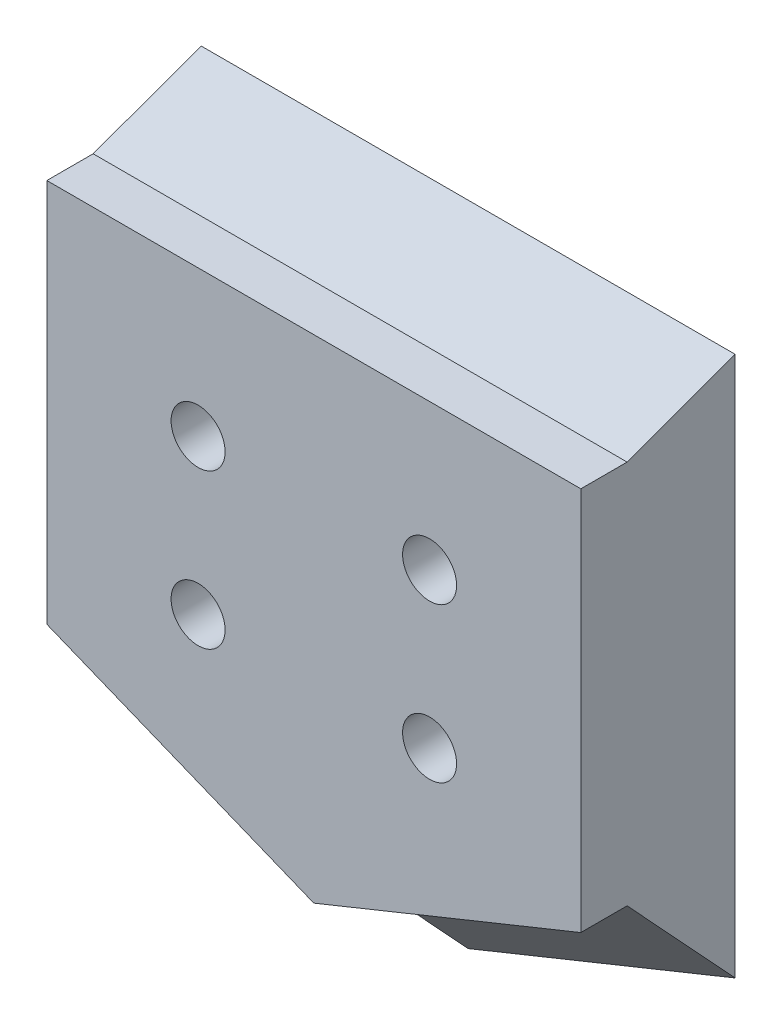
ISO-10303-21;
HEADER;
FILE_DESCRIPTION(('STEP AP214'),'2;1');
FILE_NAME('part.step','',(''),(''),'','','');
FILE_SCHEMA(('AUTOMOTIVE_DESIGN { 1 0 10303 214 1 1 1 1 }'));
ENDSEC;
DATA;
#1=APPLICATION_CONTEXT('core data for automotive mechanical design processes');
#2=APPLICATION_PROTOCOL_DEFINITION('international standard','automotive_design',2000,#1);
#3=PRODUCT_CONTEXT('',#1,'mechanical');
#4=PRODUCT('Part','Part','',(#3));
#5=PRODUCT_RELATED_PRODUCT_CATEGORY('part','',(#4));
#6=PRODUCT_DEFINITION_FORMATION('','',#4);
#7=PRODUCT_DEFINITION_CONTEXT('part definition',#1,'design');
#8=PRODUCT_DEFINITION('design','',#6,#7);
#9=PRODUCT_DEFINITION_SHAPE('','',#8);
#10=(LENGTH_UNIT() NAMED_UNIT(*) SI_UNIT(.MILLI.,.METRE.));
#11=(NAMED_UNIT(*) PLANE_ANGLE_UNIT() SI_UNIT($,.RADIAN.));
#12=(NAMED_UNIT(*) SI_UNIT($,.STERADIAN.) SOLID_ANGLE_UNIT());
#13=UNCERTAINTY_MEASURE_WITH_UNIT(LENGTH_MEASURE(1.E-05),#10,'distance_accuracy_value','');
#14=(GEOMETRIC_REPRESENTATION_CONTEXT(3) GLOBAL_UNCERTAINTY_ASSIGNED_CONTEXT((#13)) GLOBAL_UNIT_ASSIGNED_CONTEXT((#10,
#11,#12)) REPRESENTATION_CONTEXT('',''));
#15=CARTESIAN_POINT('',(0.,0.,0.));
#16=DIRECTION('',(0.,0.,1.));
#17=DIRECTION('',(1.,0.,0.));
#18=AXIS2_PLACEMENT_3D('',#15,#16,#17);
#19=CARTESIAN_POINT('',(-7.5,3.5,0.));
#20=DIRECTION('',(0.,0.,1.));
#21=DIRECTION('',(1.,0.,0.));
#22=AXIS2_PLACEMENT_3D('',#19,#20,#21);
#23=CYLINDRICAL_SURFACE('',#22,1.75);
#24=CARTESIAN_POINT('',(-7.5,3.5,10.));
#25=DIRECTION('',(0.,0.,1.));
#26=DIRECTION('',(-1.,0.,0.));
#27=AXIS2_PLACEMENT_3D('',#24,#25,#26);
#28=CIRCLE('',#27,1.75);
#29=CARTESIAN_POINT('',(-9.25,3.5,10.));
#30=VERTEX_POINT('',#29);
#31=EDGE_CURVE('E153',#30,#30,#28,.T.);
#32=ORIENTED_EDGE('',*,*,#31,.T.);
#33=EDGE_LOOP('',(#32));
#34=FACE_BOUND('',#33,.T.);
#35=CARTESIAN_POINT('',(-7.5,3.5,3.));
#36=DIRECTION('',(0.,0.,-1.));
#37=DIRECTION('',(-1.,0.,0.));
#38=AXIS2_PLACEMENT_3D('',#35,#36,#37);
#39=CIRCLE('',#38,1.75);
#40=CARTESIAN_POINT('',(-9.25,3.5,3.));
#41=VERTEX_POINT('',#40);
#42=EDGE_CURVE('E39',#41,#41,#39,.F.);
#43=ORIENTED_EDGE('',*,*,#42,.F.);
#44=EDGE_LOOP('',(#43));
#45=FACE_BOUND('',#44,.T.);
#46=ADVANCED_FACE('F35',(#34,#45),#23,.F.);
#47=CARTESIAN_POINT('',(-7.5,-6.5,0.));
#48=DIRECTION('',(0.,0.,1.));
#49=DIRECTION('',(1.,0.,0.));
#50=AXIS2_PLACEMENT_3D('',#47,#48,#49);
#51=CYLINDRICAL_SURFACE('',#50,1.75);
#52=CARTESIAN_POINT('',(-7.5,-6.5,10.));
#53=DIRECTION('',(0.,0.,1.));
#54=DIRECTION('',(-1.,0.,0.));
#55=AXIS2_PLACEMENT_3D('',#52,#53,#54);
#56=CIRCLE('',#55,1.75);
#57=CARTESIAN_POINT('',(-9.25,-6.5,10.));
#58=VERTEX_POINT('',#57);
#59=EDGE_CURVE('E177',#58,#58,#56,.T.);
#60=ORIENTED_EDGE('',*,*,#59,.T.);
#61=EDGE_LOOP('',(#60));
#62=FACE_BOUND('',#61,.T.);
#63=CARTESIAN_POINT('',(-7.5,-6.5,3.));
#64=DIRECTION('',(0.,0.,-1.));
#65=DIRECTION('',(-1.,0.,0.));
#66=AXIS2_PLACEMENT_3D('',#63,#64,#65);
#67=CIRCLE('',#66,1.75);
#68=CARTESIAN_POINT('',(-9.25,-6.5,3.));
#69=VERTEX_POINT('',#68);
#70=EDGE_CURVE('E157',#69,#69,#67,.F.);
#71=ORIENTED_EDGE('',*,*,#70,.F.);
#72=EDGE_LOOP('',(#71));
#73=FACE_BOUND('',#72,.T.);
#74=ADVANCED_FACE('F224',(#62,#73),#51,.F.);
#75=CARTESIAN_POINT('',(7.5,-6.5,0.));
#76=DIRECTION('',(0.,0.,1.));
#77=DIRECTION('',(1.,0.,0.));
#78=AXIS2_PLACEMENT_3D('',#75,#76,#77);
#79=CYLINDRICAL_SURFACE('',#78,1.75);
#80=CARTESIAN_POINT('',(7.5,-6.5,10.));
#81=DIRECTION('',(0.,0.,1.));
#82=DIRECTION('',(1.,0.,0.));
#83=AXIS2_PLACEMENT_3D('',#80,#81,#82);
#84=CIRCLE('',#83,1.75);
#85=CARTESIAN_POINT('',(9.25,-6.5,10.));
#86=VERTEX_POINT('',#85);
#87=EDGE_CURVE('E174',#86,#86,#84,.T.);
#88=ORIENTED_EDGE('',*,*,#87,.T.);
#89=EDGE_LOOP('',(#88));
#90=FACE_BOUND('',#89,.T.);
#91=CARTESIAN_POINT('',(7.5,-6.5,3.));
#92=DIRECTION('',(0.,0.,-1.));
#93=DIRECTION('',(-1.,0.,0.));
#94=AXIS2_PLACEMENT_3D('',#91,#92,#93);
#95=CIRCLE('',#94,1.75);
#96=CARTESIAN_POINT('',(5.75,-6.5,3.));
#97=VERTEX_POINT('',#96);
#98=EDGE_CURVE('E155',#97,#97,#95,.F.);
#99=ORIENTED_EDGE('',*,*,#98,.F.);
#100=EDGE_LOOP('',(#99));
#101=FACE_BOUND('',#100,.T.);
#102=ADVANCED_FACE('F230',(#90,#101),#79,.F.);
#103=CARTESIAN_POINT('',(7.5,3.5,0.));
#104=DIRECTION('',(0.,0.,1.));
#105=DIRECTION('',(1.,0.,0.));
#106=AXIS2_PLACEMENT_3D('',#103,#104,#105);
#107=CYLINDRICAL_SURFACE('',#106,1.75);
#108=CARTESIAN_POINT('',(7.5,3.5,10.));
#109=DIRECTION('',(0.,0.,1.));
#110=DIRECTION('',(1.,0.,0.));
#111=AXIS2_PLACEMENT_3D('',#108,#109,#110);
#112=CIRCLE('',#111,1.75);
#113=CARTESIAN_POINT('',(9.25,3.5,10.));
#114=VERTEX_POINT('',#113);
#115=EDGE_CURVE('E116',#114,#114,#112,.T.);
#116=ORIENTED_EDGE('',*,*,#115,.T.);
#117=EDGE_LOOP('',(#116));
#118=FACE_BOUND('',#117,.T.);
#119=CARTESIAN_POINT('',(7.5,3.5,3.));
#120=DIRECTION('',(0.,0.,-1.));
#121=DIRECTION('',(-1.,0.,0.));
#122=AXIS2_PLACEMENT_3D('',#119,#120,#121);
#123=CIRCLE('',#122,1.75);
#124=CARTESIAN_POINT('',(5.75,3.5,3.));
#125=VERTEX_POINT('',#124);
#126=EDGE_CURVE('E150',#125,#125,#123,.F.);
#127=ORIENTED_EDGE('',*,*,#126,.F.);
#128=EDGE_LOOP('',(#127));
#129=FACE_BOUND('',#128,.T.);
#130=ADVANCED_FACE('F236',(#118,#129),#107,.F.);
#131=CARTESIAN_POINT('',(17.3,13.,7.));
#132=DIRECTION('',(-1.,0.,0.));
#133=DIRECTION('',(0.,0.,1.));
#134=AXIS2_PLACEMENT_3D('',#131,#132,#133);
#135=PLANE('',#134);
#136=DIRECTION('',(0.,1.,0.));
#137=VECTOR('',#136,1.);
#138=CARTESIAN_POINT('',(17.3,13.,0.));
#139=LINE('',#138,#137);
#140=CARTESIAN_POINT('',(17.3,-19.5,0.));
#141=VERTEX_POINT('',#140);
#142=CARTESIAN_POINT('',(17.3,15.5,0.));
#143=VERTEX_POINT('',#142);
#144=EDGE_CURVE('E136',#141,#143,#139,.T.);
#145=ORIENTED_EDGE('',*,*,#144,.T.);
#146=DIRECTION('',(0.,0.342020143325666,-0.939692620785909));
#147=VECTOR('',#146,1.);
#148=CARTESIAN_POINT('',(17.3,15.5,0.));
#149=LINE('',#148,#147);
#150=CARTESIAN_POINT('',(17.3,12.9522083601366,7.));
#151=VERTEX_POINT('',#150);
#152=EDGE_CURVE('E58',#143,#151,#149,.F.);
#153=ORIENTED_EDGE('',*,*,#152,.T.);
#154=DIRECTION('',(0.,0.,-1.));
#155=VECTOR('',#154,1.);
#156=CARTESIAN_POINT('',(17.3,12.9522083601366,10.));
#157=LINE('',#156,#155);
#158=CARTESIAN_POINT('',(17.3,12.9522083601366,10.));
#159=VERTEX_POINT('',#158);
#160=EDGE_CURVE('E103',#159,#151,#157,.T.);
#161=ORIENTED_EDGE('',*,*,#160,.F.);
#162=DIRECTION('',(0.,1.,0.));
#163=VECTOR('',#162,1.);
#164=CARTESIAN_POINT('',(17.3,-11.9486875651011,10.));
#165=LINE('',#164,#163);
#166=CARTESIAN_POINT('',(17.3,-11.9486875651011,10.));
#167=VERTEX_POINT('',#166);
#168=EDGE_CURVE('E96',#167,#159,#165,.T.);
#169=ORIENTED_EDGE('',*,*,#168,.F.);
#170=DIRECTION('',(0.,0.,-1.));
#171=VECTOR('',#170,1.);
#172=CARTESIAN_POINT('',(17.3,-11.9486875651011,10.));
#173=LINE('',#172,#171);
#174=CARTESIAN_POINT('',(17.3,-11.9486875651011,7.));
#175=VERTEX_POINT('',#174);
#176=EDGE_CURVE('E100',#167,#175,#173,.T.);
#177=ORIENTED_EDGE('',*,*,#176,.T.);
#178=DIRECTION('',(0.,0.733371095333155,0.679828534654032));
#179=VECTOR('',#178,1.);
#180=CARTESIAN_POINT('',(17.3,-19.5,0.));
#181=LINE('',#180,#179);
#182=EDGE_CURVE('E144',#175,#141,#181,.F.);
#183=ORIENTED_EDGE('',*,*,#182,.T.);
#184=EDGE_LOOP('',(#145,#153,#161,#169,#177,#183));
#185=FACE_BOUND('',#184,.T.);
#186=ADVANCED_FACE('F98',(#185),#135,.F.);
#187=CARTESIAN_POINT('',(-17.3,13.,7.));
#188=DIRECTION('',(1.,0.,0.));
#189=DIRECTION('',(0.,1.,0.));
#190=AXIS2_PLACEMENT_3D('',#187,#188,#189);
#191=PLANE('',#190);
#192=DIRECTION('',(0.,-0.733371095333155,-0.679828534654032));
#193=VECTOR('',#192,1.);
#194=CARTESIAN_POINT('',(-17.3,-23.2648321442911,-3.48996617968573));
#195=LINE('',#194,#193);
#196=CARTESIAN_POINT('',(-17.3,-19.5,0.));
#197=VERTEX_POINT('',#196);
#198=CARTESIAN_POINT('',(-17.3,-11.9486875651011,7.));
#199=VERTEX_POINT('',#198);
#200=EDGE_CURVE('E146',#197,#199,#195,.F.);
#201=ORIENTED_EDGE('',*,*,#200,.T.);
#202=DIRECTION('',(0.,0.,-1.));
#203=VECTOR('',#202,1.);
#204=CARTESIAN_POINT('',(-17.3,-11.9486875651011,10.));
#205=LINE('',#204,#203);
#206=CARTESIAN_POINT('',(-17.3,-11.9486875651011,10.));
#207=VERTEX_POINT('',#206);
#208=EDGE_CURVE('E190',#207,#199,#205,.T.);
#209=ORIENTED_EDGE('',*,*,#208,.F.);
#210=DIRECTION('',(0.,-1.,0.));
#211=VECTOR('',#210,1.);
#212=CARTESIAN_POINT('',(-17.3,12.9522083601366,10.));
#213=LINE('',#212,#211);
#214=CARTESIAN_POINT('',(-17.3,12.9522083601366,10.));
#215=VERTEX_POINT('',#214);
#216=EDGE_CURVE('E185',#215,#207,#213,.T.);
#217=ORIENTED_EDGE('',*,*,#216,.F.);
#218=DIRECTION('',(0.,0.,-1.));
#219=VECTOR('',#218,1.);
#220=CARTESIAN_POINT('',(-17.3,12.9522083601366,10.));
#221=LINE('',#220,#219);
#222=CARTESIAN_POINT('',(-17.3,12.9522083601366,7.));
#223=VERTEX_POINT('',#222);
#224=EDGE_CURVE('E124',#215,#223,#221,.T.);
#225=ORIENTED_EDGE('',*,*,#224,.T.);
#226=DIRECTION('',(0.,-0.342020143325666,0.939692620785909));
#227=VECTOR('',#226,1.);
#228=CARTESIAN_POINT('',(-17.3,15.5,0.));
#229=LINE('',#228,#227);
#230=CARTESIAN_POINT('',(-17.3,15.5,0.));
#231=VERTEX_POINT('',#230);
#232=EDGE_CURVE('E11',#223,#231,#229,.F.);
#233=ORIENTED_EDGE('',*,*,#232,.T.);
#234=DIRECTION('',(0.,-1.,0.));
#235=VECTOR('',#234,1.);
#236=CARTESIAN_POINT('',(-17.3,13.,0.));
#237=LINE('',#236,#235);
#238=EDGE_CURVE('E138',#231,#197,#237,.T.);
#239=ORIENTED_EDGE('',*,*,#238,.T.);
#240=EDGE_LOOP('',(#201,#209,#217,#225,#233,#239));
#241=FACE_BOUND('',#240,.T.);
#242=ADVANCED_FACE('F196',(#241),#191,.F.);
#243=CARTESIAN_POINT('',(0.,0.,0.));
#244=DIRECTION('',(0.,0.,1.));
#245=DIRECTION('',(1.,0.,0.));
#246=AXIS2_PLACEMENT_3D('',#243,#244,#245);
#247=PLANE('',#246);
#248=CARTESIAN_POINT('',(-7.5,3.5,0.));
#249=DIRECTION('',(0.,0.,-1.));
#250=DIRECTION('',(-1.,0.,0.));
#251=AXIS2_PLACEMENT_3D('',#248,#249,#250);
#252=CIRCLE('',#251,3.5);
#253=CARTESIAN_POINT('',(-11.,3.5,0.));
#254=VERTEX_POINT('',#253);
#255=EDGE_CURVE('E286',#254,#254,#252,.T.);
#256=ORIENTED_EDGE('',*,*,#255,.F.);
#257=EDGE_LOOP('',(#256));
#258=FACE_BOUND('',#257,.T.);
#259=CARTESIAN_POINT('',(7.5,-6.5,0.));
#260=DIRECTION('',(0.,0.,-1.));
#261=DIRECTION('',(-1.,0.,0.));
#262=AXIS2_PLACEMENT_3D('',#259,#260,#261);
#263=CIRCLE('',#262,3.5);
#264=CARTESIAN_POINT('',(4.,-6.5,0.));
#265=VERTEX_POINT('',#264);
#266=EDGE_CURVE('E294',#265,#265,#263,.T.);
#267=ORIENTED_EDGE('',*,*,#266,.F.);
#268=EDGE_LOOP('',(#267));
#269=FACE_BOUND('',#268,.T.);
#270=CARTESIAN_POINT('',(-7.5,-6.5,0.));
#271=DIRECTION('',(0.,0.,-1.));
#272=DIRECTION('',(-1.,0.,0.));
#273=AXIS2_PLACEMENT_3D('',#270,#271,#272);
#274=CIRCLE('',#273,3.5);
#275=CARTESIAN_POINT('',(-11.,-6.5,0.));
#276=VERTEX_POINT('',#275);
#277=EDGE_CURVE('E299',#276,#276,#274,.T.);
#278=ORIENTED_EDGE('',*,*,#277,.F.);
#279=EDGE_LOOP('',(#278));
#280=FACE_BOUND('',#279,.T.);
#281=CARTESIAN_POINT('',(7.5,3.5,0.));
#282=DIRECTION('',(0.,0.,-1.));
#283=DIRECTION('',(-1.,0.,0.));
#284=AXIS2_PLACEMENT_3D('',#281,#282,#283);
#285=CIRCLE('',#284,3.5);
#286=CARTESIAN_POINT('',(4.,3.5,0.));
#287=VERTEX_POINT('',#286);
#288=EDGE_CURVE('E163',#287,#287,#285,.T.);
#289=ORIENTED_EDGE('',*,*,#288,.F.);
#290=EDGE_LOOP('',(#289));
#291=FACE_BOUND('',#290,.T.);
#292=ORIENTED_EDGE('',*,*,#144,.F.);
#293=DIRECTION('',(-0.926991176745522,-0.375083135099344,0.));
#294=VECTOR('',#293,1.);
#295=CARTESIAN_POINT('',(17.3,-19.5,0.));
#296=LINE('',#295,#294);
#297=CARTESIAN_POINT('',(0.,-26.5,0.));
#298=VERTEX_POINT('',#297);
#299=EDGE_CURVE('E122',#141,#298,#296,.T.);
#300=ORIENTED_EDGE('',*,*,#299,.T.);
#301=DIRECTION('',(-0.926991176745522,0.375083135099344,0.));
#302=VECTOR('',#301,1.);
#303=CARTESIAN_POINT('',(0.,-26.5,0.));
#304=LINE('',#303,#302);
#305=EDGE_CURVE('E128',#298,#197,#304,.T.);
#306=ORIENTED_EDGE('',*,*,#305,.T.);
#307=ORIENTED_EDGE('',*,*,#238,.F.);
#308=DIRECTION('',(1.,0.,0.));
#309=VECTOR('',#308,1.);
#310=CARTESIAN_POINT('',(17.3,15.5,0.));
#311=LINE('',#310,#309);
#312=EDGE_CURVE('E131',#231,#143,#311,.T.);
#313=ORIENTED_EDGE('',*,*,#312,.T.);
#314=EDGE_LOOP('',(#292,#300,#306,#307,#313));
#315=FACE_BOUND('',#314,.T.);
#316=ADVANCED_FACE('F204',(#258,#269,#280,#291,#315),#247,.F.);
#317=CARTESIAN_POINT('',(0.,-26.5,0.));
#318=DIRECTION('',(0.265223828337456,0.655481747176855,-0.707106781186549));
#319=DIRECTION('',(-0.926991176745522,0.375083135099344,0.));
#320=AXIS2_PLACEMENT_3D('',#317,#318,#319);
#321=PLANE('',#320);
#322=ORIENTED_EDGE('',*,*,#200,.F.);
#323=ORIENTED_EDGE('',*,*,#305,.F.);
#324=DIRECTION('',(0.,0.733371095333155,0.679828534654032));
#325=VECTOR('',#324,1.);
#326=CARTESIAN_POINT('',(0.,-26.5,0.));
#327=LINE('',#326,#325);
#328=CARTESIAN_POINT('',(0.,-18.9486875651011,7.));
#329=VERTEX_POINT('',#328);
#330=EDGE_CURVE('E120',#329,#298,#327,.F.);
#331=ORIENTED_EDGE('',*,*,#330,.F.);
#332=DIRECTION('',(0.926991176745522,-0.375083135099344,0.));
#333=VECTOR('',#332,1.);
#334=CARTESIAN_POINT('',(-6.5884351090578,-16.2828467695286,7.));
#335=LINE('',#334,#333);
#336=EDGE_CURVE('E140',#199,#329,#335,.T.);
#337=ORIENTED_EDGE('',*,*,#336,.F.);
#338=EDGE_LOOP('',(#322,#323,#331,#337));
#339=FACE_BOUND('',#338,.T.);
#340=ADVANCED_FACE('F210',(#339),#321,.F.);
#341=CARTESIAN_POINT('',(17.3,-19.5,0.));
#342=DIRECTION('',(-0.265223828337456,0.655481747176855,-0.707106781186549));
#343=DIRECTION('',(-0.926991176745522,-0.375083135099344,0.));
#344=AXIS2_PLACEMENT_3D('',#341,#342,#343);
#345=PLANE('',#344);
#346=ORIENTED_EDGE('',*,*,#182,.F.);
#347=DIRECTION('',(0.926991176745522,0.375083135099344,0.));
#348=VECTOR('',#347,1.);
#349=CARTESIAN_POINT('',(6.5884351090578,-16.2828467695286,7.));
#350=LINE('',#349,#348);
#351=EDGE_CURVE('E119',#329,#175,#350,.T.);
#352=ORIENTED_EDGE('',*,*,#351,.F.);
#353=ORIENTED_EDGE('',*,*,#330,.T.);
#354=ORIENTED_EDGE('',*,*,#299,.F.);
#355=EDGE_LOOP('',(#346,#352,#353,#354));
#356=FACE_BOUND('',#355,.T.);
#357=ADVANCED_FACE('F312',(#356),#345,.F.);
#358=CARTESIAN_POINT('',(17.3,15.5,0.));
#359=DIRECTION('',(0.,-0.939692620785909,-0.342020143325666));
#360=DIRECTION('',(1.,0.,0.));
#361=AXIS2_PLACEMENT_3D('',#358,#359,#360);
#362=PLANE('',#361);
#363=ORIENTED_EDGE('',*,*,#232,.F.);
#364=DIRECTION('',(-1.,0.,0.));
#365=VECTOR('',#364,1.);
#366=CARTESIAN_POINT('',(0.,12.9522083601366,7.));
#367=LINE('',#366,#365);
#368=EDGE_CURVE('E44',#151,#223,#367,.T.);
#369=ORIENTED_EDGE('',*,*,#368,.F.);
#370=ORIENTED_EDGE('',*,*,#152,.F.);
#371=ORIENTED_EDGE('',*,*,#312,.F.);
#372=EDGE_LOOP('',(#363,#369,#370,#371));
#373=FACE_BOUND('',#372,.T.);
#374=ADVANCED_FACE('F37',(#373),#362,.F.);
#375=CARTESIAN_POINT('',(0.,-18.9486875651011,10.));
#376=DIRECTION('',(-0.375083135099344,0.926991176745522,0.));
#377=DIRECTION('',(-0.926991176745522,-0.375083135099344,0.));
#378=AXIS2_PLACEMENT_3D('',#375,#376,#377);
#379=PLANE('',#378);
#380=ORIENTED_EDGE('',*,*,#351,.T.);
#381=ORIENTED_EDGE('',*,*,#176,.F.);
#382=DIRECTION('',(0.926991176745522,0.375083135099345,0.));
#383=VECTOR('',#382,1.);
#384=CARTESIAN_POINT('',(0.,-18.9486875651011,10.));
#385=LINE('',#384,#383);
#386=CARTESIAN_POINT('',(0.,-18.9486875651011,10.));
#387=VERTEX_POINT('',#386);
#388=EDGE_CURVE('E107',#387,#167,#385,.T.);
#389=ORIENTED_EDGE('',*,*,#388,.F.);
#390=DIRECTION('',(0.,0.,-1.));
#391=VECTOR('',#390,1.);
#392=CARTESIAN_POINT('',(0.,-18.9486875651011,10.));
#393=LINE('',#392,#391);
#394=EDGE_CURVE('E188',#387,#329,#393,.T.);
#395=ORIENTED_EDGE('',*,*,#394,.T.);
#396=EDGE_LOOP('',(#380,#381,#389,#395));
#397=FACE_BOUND('',#396,.T.);
#398=ADVANCED_FACE('F118',(#397),#379,.F.);
#399=CARTESIAN_POINT('',(17.3,12.9522083601366,10.));
#400=DIRECTION('',(0.,-1.,0.));
#401=DIRECTION('',(0.,0.,-1.));
#402=AXIS2_PLACEMENT_3D('',#399,#400,#401);
#403=PLANE('',#402);
#404=ORIENTED_EDGE('',*,*,#368,.T.);
#405=ORIENTED_EDGE('',*,*,#224,.F.);
#406=DIRECTION('',(-1.,0.,0.));
#407=VECTOR('',#406,1.);
#408=CARTESIAN_POINT('',(17.3,12.9522083601366,10.));
#409=LINE('',#408,#407);
#410=EDGE_CURVE('E106',#159,#215,#409,.T.);
#411=ORIENTED_EDGE('',*,*,#410,.F.);
#412=ORIENTED_EDGE('',*,*,#160,.T.);
#413=EDGE_LOOP('',(#404,#405,#411,#412));
#414=FACE_BOUND('',#413,.T.);
#415=ADVANCED_FACE('F200',(#414),#403,.F.);
#416=CARTESIAN_POINT('',(-17.3,-11.9486875651011,10.));
#417=DIRECTION('',(0.375083135099344,0.926991176745522,0.));
#418=DIRECTION('',(-0.926991176745522,0.375083135099345,0.));
#419=AXIS2_PLACEMENT_3D('',#416,#417,#418);
#420=PLANE('',#419);
#421=ORIENTED_EDGE('',*,*,#336,.T.);
#422=ORIENTED_EDGE('',*,*,#394,.F.);
#423=DIRECTION('',(0.926991176745521,-0.375083135099344,0.));
#424=VECTOR('',#423,1.);
#425=CARTESIAN_POINT('',(-17.3,-11.9486875651011,10.));
#426=LINE('',#425,#424);
#427=EDGE_CURVE('E112',#207,#387,#426,.T.);
#428=ORIENTED_EDGE('',*,*,#427,.F.);
#429=ORIENTED_EDGE('',*,*,#208,.T.);
#430=EDGE_LOOP('',(#421,#422,#428,#429));
#431=FACE_BOUND('',#430,.T.);
#432=ADVANCED_FACE('F212',(#431),#420,.F.);
#433=CARTESIAN_POINT('',(0.,0.,10.));
#434=DIRECTION('',(0.,0.,1.));
#435=DIRECTION('',(1.,0.,0.));
#436=AXIS2_PLACEMENT_3D('',#433,#434,#435);
#437=PLANE('',#436);
#438=ORIENTED_EDGE('',*,*,#87,.F.);
#439=EDGE_LOOP('',(#438));
#440=FACE_BOUND('',#439,.T.);
#441=ORIENTED_EDGE('',*,*,#59,.F.);
#442=EDGE_LOOP('',(#441));
#443=FACE_BOUND('',#442,.T.);
#444=ORIENTED_EDGE('',*,*,#31,.F.);
#445=EDGE_LOOP('',(#444));
#446=FACE_BOUND('',#445,.T.);
#447=ORIENTED_EDGE('',*,*,#115,.F.);
#448=EDGE_LOOP('',(#447));
#449=FACE_BOUND('',#448,.T.);
#450=ORIENTED_EDGE('',*,*,#388,.T.);
#451=ORIENTED_EDGE('',*,*,#168,.T.);
#452=ORIENTED_EDGE('',*,*,#410,.T.);
#453=ORIENTED_EDGE('',*,*,#216,.T.);
#454=ORIENTED_EDGE('',*,*,#427,.T.);
#455=EDGE_LOOP('',(#450,#451,#452,#453,#454));
#456=FACE_BOUND('',#455,.T.);
#457=ADVANCED_FACE('F110',(#440,#443,#446,#449,#456),#437,.T.);
#458=CARTESIAN_POINT('',(7.5,3.5,3.));
#459=DIRECTION('',(0.,0.,-1.));
#460=DIRECTION('',(-1.,0.,0.));
#461=AXIS2_PLACEMENT_3D('',#458,#459,#460);
#462=PLANE('',#461);
#463=CARTESIAN_POINT('',(7.5,3.5,3.));
#464=DIRECTION('',(0.,0.,-1.));
#465=DIRECTION('',(-1.,0.,0.));
#466=AXIS2_PLACEMENT_3D('',#463,#464,#465);
#467=CIRCLE('',#466,3.5);
#468=CARTESIAN_POINT('',(4.,3.5,3.));
#469=VERTEX_POINT('',#468);
#470=EDGE_CURVE('E154',#469,#469,#467,.T.);
#471=ORIENTED_EDGE('',*,*,#470,.T.);
#472=EDGE_LOOP('',(#471));
#473=FACE_BOUND('',#472,.T.);
#474=ORIENTED_EDGE('',*,*,#126,.T.);
#475=EDGE_LOOP('',(#474));
#476=FACE_BOUND('',#475,.T.);
#477=ADVANCED_FACE('F219',(#473,#476),#462,.T.);
#478=CARTESIAN_POINT('',(7.5,3.5,3.));
#479=DIRECTION('',(0.,0.,-1.));
#480=DIRECTION('',(-1.,0.,0.));
#481=AXIS2_PLACEMENT_3D('',#478,#479,#480);
#482=CYLINDRICAL_SURFACE('',#481,3.5);
#483=ORIENTED_EDGE('',*,*,#470,.F.);
#484=EDGE_LOOP('',(#483));
#485=FACE_BOUND('',#484,.T.);
#486=ORIENTED_EDGE('',*,*,#288,.T.);
#487=EDGE_LOOP('',(#486));
#488=FACE_BOUND('',#487,.T.);
#489=ADVANCED_FACE('F250',(#485,#488),#482,.F.);
#490=CARTESIAN_POINT('',(7.5,-6.5,3.));
#491=DIRECTION('',(0.,0.,-1.));
#492=DIRECTION('',(-1.,0.,0.));
#493=AXIS2_PLACEMENT_3D('',#490,#491,#492);
#494=PLANE('',#493);
#495=CARTESIAN_POINT('',(7.5,-6.5,3.));
#496=DIRECTION('',(0.,0.,-1.));
#497=DIRECTION('',(-1.,0.,0.));
#498=AXIS2_PLACEMENT_3D('',#495,#496,#497);
#499=CIRCLE('',#498,3.5);
#500=CARTESIAN_POINT('',(4.,-6.5,3.));
#501=VERTEX_POINT('',#500);
#502=EDGE_CURVE('E289',#501,#501,#499,.T.);
#503=ORIENTED_EDGE('',*,*,#502,.T.);
#504=EDGE_LOOP('',(#503));
#505=FACE_BOUND('',#504,.T.);
#506=ORIENTED_EDGE('',*,*,#98,.T.);
#507=EDGE_LOOP('',(#506));
#508=FACE_BOUND('',#507,.T.);
#509=ADVANCED_FACE('F256',(#505,#508),#494,.T.);
#510=CARTESIAN_POINT('',(7.5,-6.5,3.));
#511=DIRECTION('',(0.,0.,-1.));
#512=DIRECTION('',(-1.,0.,0.));
#513=AXIS2_PLACEMENT_3D('',#510,#511,#512);
#514=CYLINDRICAL_SURFACE('',#513,3.5);
#515=ORIENTED_EDGE('',*,*,#502,.F.);
#516=EDGE_LOOP('',(#515));
#517=FACE_BOUND('',#516,.T.);
#518=ORIENTED_EDGE('',*,*,#266,.T.);
#519=EDGE_LOOP('',(#518));
#520=FACE_BOUND('',#519,.T.);
#521=ADVANCED_FACE('F268',(#517,#520),#514,.F.);
#522=CARTESIAN_POINT('',(-7.5,-6.5,3.));
#523=DIRECTION('',(0.,0.,-1.));
#524=DIRECTION('',(-1.,0.,0.));
#525=AXIS2_PLACEMENT_3D('',#522,#523,#524);
#526=PLANE('',#525);
#527=CARTESIAN_POINT('',(-7.5,-6.5,3.));
#528=DIRECTION('',(0.,0.,-1.));
#529=DIRECTION('',(-1.,0.,0.));
#530=AXIS2_PLACEMENT_3D('',#527,#528,#529);
#531=CIRCLE('',#530,3.5);
#532=CARTESIAN_POINT('',(-11.,-6.5,3.));
#533=VERTEX_POINT('',#532);
#534=EDGE_CURVE('E297',#533,#533,#531,.T.);
#535=ORIENTED_EDGE('',*,*,#534,.T.);
#536=EDGE_LOOP('',(#535));
#537=FACE_BOUND('',#536,.T.);
#538=ORIENTED_EDGE('',*,*,#70,.T.);
#539=EDGE_LOOP('',(#538));
#540=FACE_BOUND('',#539,.T.);
#541=ADVANCED_FACE('F264',(#537,#540),#526,.T.);
#542=CARTESIAN_POINT('',(-7.5,-6.5,3.));
#543=DIRECTION('',(0.,0.,-1.));
#544=DIRECTION('',(-1.,0.,0.));
#545=AXIS2_PLACEMENT_3D('',#542,#543,#544);
#546=CYLINDRICAL_SURFACE('',#545,3.5);
#547=ORIENTED_EDGE('',*,*,#534,.F.);
#548=EDGE_LOOP('',(#547));
#549=FACE_BOUND('',#548,.T.);
#550=ORIENTED_EDGE('',*,*,#277,.T.);
#551=EDGE_LOOP('',(#550));
#552=FACE_BOUND('',#551,.T.);
#553=ADVANCED_FACE('F260',(#549,#552),#546,.F.);
#554=CARTESIAN_POINT('',(-7.5,3.5,3.));
#555=DIRECTION('',(0.,0.,-1.));
#556=DIRECTION('',(-1.,0.,0.));
#557=AXIS2_PLACEMENT_3D('',#554,#555,#556);
#558=PLANE('',#557);
#559=CARTESIAN_POINT('',(-7.5,3.5,3.));
#560=DIRECTION('',(0.,0.,-1.));
#561=DIRECTION('',(-1.,0.,0.));
#562=AXIS2_PLACEMENT_3D('',#559,#560,#561);
#563=CIRCLE('',#562,3.5);
#564=CARTESIAN_POINT('',(-11.,3.5,3.));
#565=VERTEX_POINT('',#564);
#566=EDGE_CURVE('E158',#565,#565,#563,.T.);
#567=ORIENTED_EDGE('',*,*,#566,.T.);
#568=EDGE_LOOP('',(#567));
#569=FACE_BOUND('',#568,.T.);
#570=ORIENTED_EDGE('',*,*,#42,.T.);
#571=EDGE_LOOP('',(#570));
#572=FACE_BOUND('',#571,.T.);
#573=ADVANCED_FACE('F263',(#569,#572),#558,.T.);
#574=CARTESIAN_POINT('',(-7.5,3.5,3.));
#575=DIRECTION('',(0.,0.,-1.));
#576=DIRECTION('',(-1.,0.,0.));
#577=AXIS2_PLACEMENT_3D('',#574,#575,#576);
#578=CYLINDRICAL_SURFACE('',#577,3.5);
#579=ORIENTED_EDGE('',*,*,#566,.F.);
#580=EDGE_LOOP('',(#579));
#581=FACE_BOUND('',#580,.T.);
#582=ORIENTED_EDGE('',*,*,#255,.T.);
#583=EDGE_LOOP('',(#582));
#584=FACE_BOUND('',#583,.T.);
#585=ADVANCED_FACE('F276',(#581,#584),#578,.F.);
#586=CLOSED_SHELL('',(#46,#74,#102,#130,#186,#242,#316,#340,#357,#374,#398,#415,#432,#457,#477,
#489,#509,#521,#541,#553,#573,#585));
#587=MANIFOLD_SOLID_BREP('B2',#586);
#588=ADVANCED_BREP_SHAPE_REPRESENTATION('',(#18,#587),#14);
#589=SHAPE_DEFINITION_REPRESENTATION(#9,#588);
ENDSEC;
END-ISO-10303-21;
